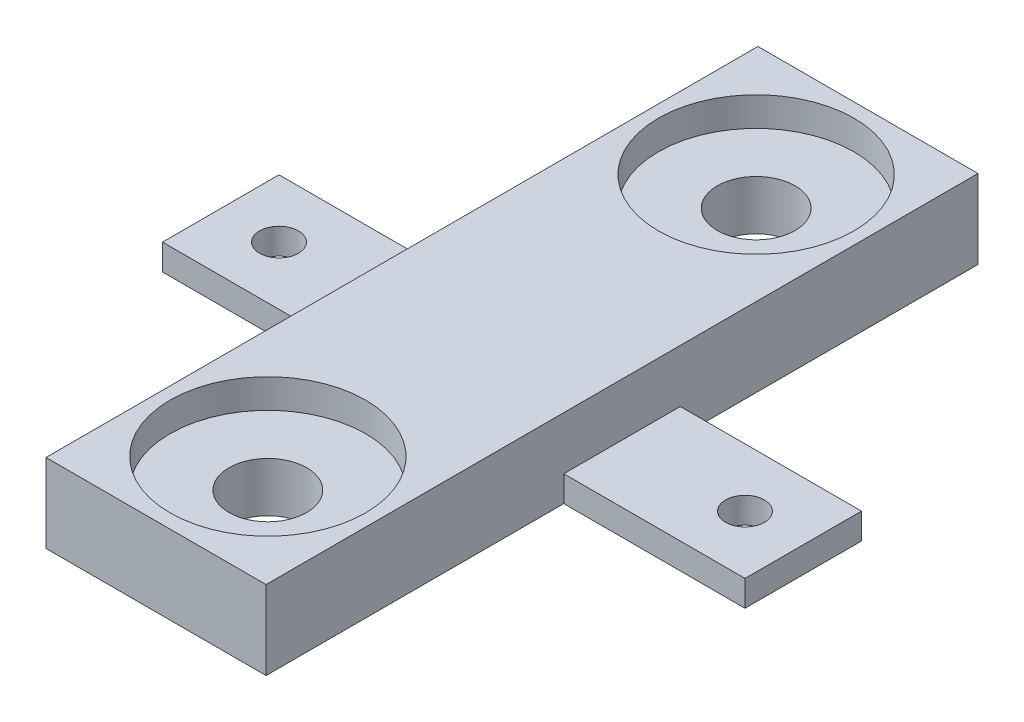
ISO-10303-21;
HEADER;
FILE_DESCRIPTION(('STEP AP214'),'2;1');
FILE_NAME('part.step','',(''),(''),'','','');
FILE_SCHEMA(('AUTOMOTIVE_DESIGN { 1 0 10303 214 1 1 1 1 }'));
ENDSEC;
DATA;
#1=APPLICATION_CONTEXT('core data for automotive mechanical design processes');
#2=APPLICATION_PROTOCOL_DEFINITION('international standard','automotive_design',2000,#1);
#3=PRODUCT_CONTEXT('',#1,'mechanical');
#4=PRODUCT('Part','Part','',(#3));
#5=PRODUCT_RELATED_PRODUCT_CATEGORY('part','',(#4));
#6=PRODUCT_DEFINITION_FORMATION('','',#4);
#7=PRODUCT_DEFINITION_CONTEXT('part definition',#1,'design');
#8=PRODUCT_DEFINITION('design','',#6,#7);
#9=PRODUCT_DEFINITION_SHAPE('','',#8);
#10=(LENGTH_UNIT() NAMED_UNIT(*) SI_UNIT(.MILLI.,.METRE.));
#11=(NAMED_UNIT(*) PLANE_ANGLE_UNIT() SI_UNIT($,.RADIAN.));
#12=(NAMED_UNIT(*) SI_UNIT($,.STERADIAN.) SOLID_ANGLE_UNIT());
#13=UNCERTAINTY_MEASURE_WITH_UNIT(LENGTH_MEASURE(1.E-05),#10,'distance_accuracy_value','');
#14=(GEOMETRIC_REPRESENTATION_CONTEXT(3) GLOBAL_UNCERTAINTY_ASSIGNED_CONTEXT((#13)) GLOBAL_UNIT_ASSIGNED_CONTEXT((#10,
#11,#12)) REPRESENTATION_CONTEXT('',''));
#15=CARTESIAN_POINT('',(0.,0.,0.));
#16=DIRECTION('',(0.,0.,1.));
#17=DIRECTION('',(1.,0.,0.));
#18=AXIS2_PLACEMENT_3D('',#15,#16,#17);
#19=CARTESIAN_POINT('',(0.,2.,0.));
#20=DIRECTION('',(0.,1.,0.));
#21=DIRECTION('',(0.,0.,1.));
#22=AXIS2_PLACEMENT_3D('',#19,#20,#21);
#23=PLANE('',#22);
#24=CARTESIAN_POINT('',(-18.,2.,0.));
#25=DIRECTION('',(0.,1.,0.));
#26=DIRECTION('',(0.,0.,1.));
#27=AXIS2_PLACEMENT_3D('',#24,#25,#26);
#28=CIRCLE('',#27,1.5);
#29=CARTESIAN_POINT('',(-18.,2.,1.5));
#30=VERTEX_POINT('',#29);
#31=EDGE_CURVE('E175',#30,#30,#28,.T.);
#32=ORIENTED_EDGE('',*,*,#31,.F.);
#33=EDGE_LOOP('',(#32));
#34=FACE_BOUND('',#33,.T.);
#35=DIRECTION('',(-1.,0.,0.));
#36=VECTOR('',#35,1.);
#37=CARTESIAN_POINT('',(0.,2.,4.49999999999999));
#38=LINE('',#37,#36);
#39=CARTESIAN_POINT('',(-8.5,2.,4.5));
#40=VERTEX_POINT('',#39);
#41=CARTESIAN_POINT('',(-22.5,2.,4.5));
#42=VERTEX_POINT('',#41);
#43=EDGE_CURVE('E161',#40,#42,#38,.T.);
#44=ORIENTED_EDGE('',*,*,#43,.F.);
#45=DIRECTION('',(0.,0.,-1.));
#46=VECTOR('',#45,1.);
#47=CARTESIAN_POINT('',(-8.5,2.,0.));
#48=LINE('',#47,#46);
#49=CARTESIAN_POINT('',(-8.5,2.,-4.5));
#50=VERTEX_POINT('',#49);
#51=EDGE_CURVE('E261',#40,#50,#48,.T.);
#52=ORIENTED_EDGE('',*,*,#51,.T.);
#53=DIRECTION('',(-1.,0.,0.));
#54=VECTOR('',#53,1.);
#55=CARTESIAN_POINT('',(0.,2.,-4.49999999999999));
#56=LINE('',#55,#54);
#57=CARTESIAN_POINT('',(-22.5,2.,-4.5));
#58=VERTEX_POINT('',#57);
#59=EDGE_CURVE('E144',#50,#58,#56,.T.);
#60=ORIENTED_EDGE('',*,*,#59,.T.);
#61=DIRECTION('',(0.,0.,1.));
#62=VECTOR('',#61,1.);
#63=CARTESIAN_POINT('',(-22.5,2.,0.));
#64=LINE('',#63,#62);
#65=EDGE_CURVE('E275',#58,#42,#64,.T.);
#66=ORIENTED_EDGE('',*,*,#65,.T.);
#67=EDGE_LOOP('',(#44,#52,#60,#66));
#68=FACE_BOUND('',#67,.T.);
#69=ADVANCED_FACE('F70',(#34,#68),#23,.T.);
#70=CARTESIAN_POINT('',(0.,2.,-27.5));
#71=DIRECTION('',(0.,0.,-1.));
#72=DIRECTION('',(-1.,0.,0.));
#73=AXIS2_PLACEMENT_3D('',#70,#71,#72);
#74=PLANE('',#73);
#75=DIRECTION('',(1.,0.,0.));
#76=VECTOR('',#75,1.);
#77=CARTESIAN_POINT('',(0.,0.,-27.5));
#78=LINE('',#77,#76);
#79=CARTESIAN_POINT('',(-8.5,0.,-27.5));
#80=VERTEX_POINT('',#79);
#81=CARTESIAN_POINT('',(8.5,0.,-27.5));
#82=VERTEX_POINT('',#81);
#83=EDGE_CURVE('E186',#80,#82,#78,.T.);
#84=ORIENTED_EDGE('',*,*,#83,.F.);
#85=DIRECTION('',(0.,-1.,0.));
#86=VECTOR('',#85,1.);
#87=CARTESIAN_POINT('',(-8.5,2.,-27.5));
#88=LINE('',#87,#86);
#89=CARTESIAN_POINT('',(-8.5,6.088,-27.5));
#90=VERTEX_POINT('',#89);
#91=EDGE_CURVE('E235',#90,#80,#88,.T.);
#92=ORIENTED_EDGE('',*,*,#91,.F.);
#93=DIRECTION('',(1.,0.,0.));
#94=VECTOR('',#93,1.);
#95=CARTESIAN_POINT('',(0.,6.088,-27.5));
#96=LINE('',#95,#94);
#97=CARTESIAN_POINT('',(8.5,6.088,-27.5));
#98=VERTEX_POINT('',#97);
#99=EDGE_CURVE('E267',#90,#98,#96,.T.);
#100=ORIENTED_EDGE('',*,*,#99,.T.);
#101=DIRECTION('',(0.,-1.,0.));
#102=VECTOR('',#101,1.);
#103=CARTESIAN_POINT('',(8.5,2.,-27.5));
#104=LINE('',#103,#102);
#105=EDGE_CURVE('E237',#98,#82,#104,.T.);
#106=ORIENTED_EDGE('',*,*,#105,.T.);
#107=EDGE_LOOP('',(#84,#92,#100,#106));
#108=FACE_BOUND('',#107,.T.);
#109=ADVANCED_FACE('F72',(#108),#74,.T.);
#110=CARTESIAN_POINT('',(0.,2.,-4.49999999999999));
#111=DIRECTION('',(0.,0.,1.));
#112=DIRECTION('',(1.,0.,0.));
#113=AXIS2_PLACEMENT_3D('',#110,#111,#112);
#114=PLANE('',#113);
#115=DIRECTION('',(-1.,0.,0.));
#116=VECTOR('',#115,1.);
#117=CARTESIAN_POINT('',(0.,0.,-4.49999999999999));
#118=LINE('',#117,#116);
#119=CARTESIAN_POINT('',(-8.5,0.,-4.5));
#120=VERTEX_POINT('',#119);
#121=CARTESIAN_POINT('',(-22.5,0.,-4.5));
#122=VERTEX_POINT('',#121);
#123=EDGE_CURVE('E193',#120,#122,#118,.T.);
#124=ORIENTED_EDGE('',*,*,#123,.T.);
#125=DIRECTION('',(0.,-1.,0.));
#126=VECTOR('',#125,1.);
#127=CARTESIAN_POINT('',(-22.5,2.,-4.5));
#128=LINE('',#127,#126);
#129=EDGE_CURVE('E229',#58,#122,#128,.T.);
#130=ORIENTED_EDGE('',*,*,#129,.F.);
#131=ORIENTED_EDGE('',*,*,#59,.F.);
#132=DIRECTION('',(0.,-1.,0.));
#133=VECTOR('',#132,1.);
#134=CARTESIAN_POINT('',(-8.5,2.,-4.5));
#135=LINE('',#134,#133);
#136=EDGE_CURVE('E232',#50,#120,#135,.T.);
#137=ORIENTED_EDGE('',*,*,#136,.T.);
#138=EDGE_LOOP('',(#124,#130,#131,#137));
#139=FACE_BOUND('',#138,.T.);
#140=ADVANCED_FACE('F342',(#139),#114,.F.);
#141=CARTESIAN_POINT('',(-22.5,2.,0.));
#142=DIRECTION('',(1.,0.,0.));
#143=DIRECTION('',(0.,0.,-1.));
#144=AXIS2_PLACEMENT_3D('',#141,#142,#143);
#145=PLANE('',#144);
#146=DIRECTION('',(0.,0.,1.));
#147=VECTOR('',#146,1.);
#148=CARTESIAN_POINT('',(-22.5,0.,0.));
#149=LINE('',#148,#147);
#150=CARTESIAN_POINT('',(-22.5,0.,4.5));
#151=VERTEX_POINT('',#150);
#152=EDGE_CURVE('E196',#122,#151,#149,.T.);
#153=ORIENTED_EDGE('',*,*,#152,.T.);
#154=DIRECTION('',(0.,-1.,0.));
#155=VECTOR('',#154,1.);
#156=CARTESIAN_POINT('',(-22.5,2.,4.5));
#157=LINE('',#156,#155);
#158=EDGE_CURVE('E227',#42,#151,#157,.T.);
#159=ORIENTED_EDGE('',*,*,#158,.F.);
#160=ORIENTED_EDGE('',*,*,#65,.F.);
#161=ORIENTED_EDGE('',*,*,#129,.T.);
#162=EDGE_LOOP('',(#153,#159,#160,#161));
#163=FACE_BOUND('',#162,.T.);
#164=ADVANCED_FACE('F496',(#163),#145,.F.);
#165=CARTESIAN_POINT('',(0.,2.,4.49999999999999));
#166=DIRECTION('',(0.,0.,1.));
#167=DIRECTION('',(1.,0.,0.));
#168=AXIS2_PLACEMENT_3D('',#165,#166,#167);
#169=PLANE('',#168);
#170=DIRECTION('',(-1.,0.,0.));
#171=VECTOR('',#170,1.);
#172=CARTESIAN_POINT('',(0.,0.,4.49999999999999));
#173=LINE('',#172,#171);
#174=CARTESIAN_POINT('',(-8.5,0.,4.49999999999999));
#175=VERTEX_POINT('',#174);
#176=EDGE_CURVE('E199',#175,#151,#173,.T.);
#177=ORIENTED_EDGE('',*,*,#176,.F.);
#178=DIRECTION('',(0.,-1.,0.));
#179=VECTOR('',#178,1.);
#180=CARTESIAN_POINT('',(-8.5,2.,4.49999999999999));
#181=LINE('',#180,#179);
#182=EDGE_CURVE('E225',#40,#175,#181,.T.);
#183=ORIENTED_EDGE('',*,*,#182,.F.);
#184=ORIENTED_EDGE('',*,*,#43,.T.);
#185=ORIENTED_EDGE('',*,*,#158,.T.);
#186=EDGE_LOOP('',(#177,#183,#184,#185));
#187=FACE_BOUND('',#186,.T.);
#188=ADVANCED_FACE('F281',(#187),#169,.T.);
#189=CARTESIAN_POINT('',(-8.5,2.,0.));
#190=DIRECTION('',(1.,0.,0.));
#191=DIRECTION('',(0.,0.,-1.));
#192=AXIS2_PLACEMENT_3D('',#189,#190,#191);
#193=PLANE('',#192);
#194=DIRECTION('',(0.,0.,1.));
#195=VECTOR('',#194,1.);
#196=CARTESIAN_POINT('',(-8.5,0.,0.));
#197=LINE('',#196,#195);
#198=CARTESIAN_POINT('',(-8.49999999999999,0.,27.5));
#199=VERTEX_POINT('',#198);
#200=EDGE_CURVE('E194',#175,#199,#197,.T.);
#201=ORIENTED_EDGE('',*,*,#200,.T.);
#202=DIRECTION('',(0.,-1.,0.));
#203=VECTOR('',#202,1.);
#204=CARTESIAN_POINT('',(-8.49999999999999,2.,27.5));
#205=LINE('',#204,#203);
#206=CARTESIAN_POINT('',(-8.49999999999999,6.088,27.5));
#207=VERTEX_POINT('',#206);
#208=EDGE_CURVE('E222',#207,#199,#205,.T.);
#209=ORIENTED_EDGE('',*,*,#208,.F.);
#210=DIRECTION('',(0.,0.,1.));
#211=VECTOR('',#210,1.);
#212=CARTESIAN_POINT('',(-8.5,6.088,0.));
#213=LINE('',#212,#211);
#214=EDGE_CURVE('E187',#90,#207,#213,.T.);
#215=ORIENTED_EDGE('',*,*,#214,.F.);
#216=ORIENTED_EDGE('',*,*,#91,.T.);
#217=EDGE_CURVE('E191',#80,#120,#197,.T.);
#218=ORIENTED_EDGE('',*,*,#217,.T.);
#219=ORIENTED_EDGE('',*,*,#136,.F.);
#220=ORIENTED_EDGE('',*,*,#51,.F.);
#221=ORIENTED_EDGE('',*,*,#182,.T.);
#222=EDGE_LOOP('',(#201,#209,#215,#216,#218,#219,#220,#221));
#223=FACE_BOUND('',#222,.T.);
#224=ADVANCED_FACE('F317',(#223),#193,.F.);
#225=CARTESIAN_POINT('',(0.,2.,27.5));
#226=DIRECTION('',(0.,0.,-1.));
#227=DIRECTION('',(-1.,0.,0.));
#228=AXIS2_PLACEMENT_3D('',#225,#226,#227);
#229=PLANE('',#228);
#230=DIRECTION('',(1.,0.,0.));
#231=VECTOR('',#230,1.);
#232=CARTESIAN_POINT('',(0.,0.,27.5));
#233=LINE('',#232,#231);
#234=CARTESIAN_POINT('',(8.5,0.,27.5));
#235=VERTEX_POINT('',#234);
#236=EDGE_CURVE('E202',#199,#235,#233,.T.);
#237=ORIENTED_EDGE('',*,*,#236,.T.);
#238=DIRECTION('',(0.,-1.,0.));
#239=VECTOR('',#238,1.);
#240=CARTESIAN_POINT('',(8.5,2.,27.5));
#241=LINE('',#240,#239);
#242=CARTESIAN_POINT('',(8.5,6.088,27.5));
#243=VERTEX_POINT('',#242);
#244=EDGE_CURVE('E220',#243,#235,#241,.T.);
#245=ORIENTED_EDGE('',*,*,#244,.F.);
#246=DIRECTION('',(1.,0.,0.));
#247=VECTOR('',#246,1.);
#248=CARTESIAN_POINT('',(0.,6.088,27.5));
#249=LINE('',#248,#247);
#250=EDGE_CURVE('E258',#207,#243,#249,.T.);
#251=ORIENTED_EDGE('',*,*,#250,.F.);
#252=ORIENTED_EDGE('',*,*,#208,.T.);
#253=EDGE_LOOP('',(#237,#245,#251,#252));
#254=FACE_BOUND('',#253,.T.);
#255=ADVANCED_FACE('F304',(#254),#229,.F.);
#256=CARTESIAN_POINT('',(8.5,2.,0.));
#257=DIRECTION('',(1.,0.,0.));
#258=DIRECTION('',(0.,0.,-1.));
#259=AXIS2_PLACEMENT_3D('',#256,#257,#258);
#260=PLANE('',#259);
#261=DIRECTION('',(0.,0.,1.));
#262=VECTOR('',#261,1.);
#263=CARTESIAN_POINT('',(8.5,0.,0.));
#264=LINE('',#263,#262);
#265=CARTESIAN_POINT('',(8.5,0.,4.5));
#266=VERTEX_POINT('',#265);
#267=EDGE_CURVE('E188',#266,#235,#264,.T.);
#268=ORIENTED_EDGE('',*,*,#267,.F.);
#269=DIRECTION('',(0.,-1.,0.));
#270=VECTOR('',#269,1.);
#271=CARTESIAN_POINT('',(8.5,2.,4.5));
#272=LINE('',#271,#270);
#273=CARTESIAN_POINT('',(8.5,2.,4.49999999999999));
#274=VERTEX_POINT('',#273);
#275=EDGE_CURVE('E170',#274,#266,#272,.T.);
#276=ORIENTED_EDGE('',*,*,#275,.F.);
#277=DIRECTION('',(0.,0.,-1.));
#278=VECTOR('',#277,1.);
#279=CARTESIAN_POINT('',(8.5,2.,0.));
#280=LINE('',#279,#278);
#281=CARTESIAN_POINT('',(8.5,2.,-4.5));
#282=VERTEX_POINT('',#281);
#283=EDGE_CURVE('E89',#274,#282,#280,.T.);
#284=ORIENTED_EDGE('',*,*,#283,.T.);
#285=DIRECTION('',(0.,-1.,0.));
#286=VECTOR('',#285,1.);
#287=CARTESIAN_POINT('',(8.5,2.,-4.5));
#288=LINE('',#287,#286);
#289=CARTESIAN_POINT('',(8.5,0.,-4.5));
#290=VERTEX_POINT('',#289);
#291=EDGE_CURVE('E135',#282,#290,#288,.T.);
#292=ORIENTED_EDGE('',*,*,#291,.T.);
#293=EDGE_CURVE('E184',#82,#290,#264,.T.);
#294=ORIENTED_EDGE('',*,*,#293,.F.);
#295=ORIENTED_EDGE('',*,*,#105,.F.);
#296=DIRECTION('',(0.,0.,1.));
#297=VECTOR('',#296,1.);
#298=CARTESIAN_POINT('',(8.5,6.088,0.));
#299=LINE('',#298,#297);
#300=EDGE_CURVE('E264',#98,#243,#299,.T.);
#301=ORIENTED_EDGE('',*,*,#300,.T.);
#302=ORIENTED_EDGE('',*,*,#244,.T.);
#303=EDGE_LOOP('',(#268,#276,#284,#292,#294,#295,#301,#302));
#304=FACE_BOUND('',#303,.T.);
#305=ADVANCED_FACE('F313',(#304),#260,.T.);
#306=CARTESIAN_POINT('',(0.,2.,4.5));
#307=DIRECTION('',(0.,0.,-1.));
#308=DIRECTION('',(-1.,0.,0.));
#309=AXIS2_PLACEMENT_3D('',#306,#307,#308);
#310=PLANE('',#309);
#311=DIRECTION('',(1.,0.,0.));
#312=VECTOR('',#311,1.);
#313=CARTESIAN_POINT('',(0.,0.,4.5));
#314=LINE('',#313,#312);
#315=CARTESIAN_POINT('',(22.5,0.,4.49999999999999));
#316=VERTEX_POINT('',#315);
#317=EDGE_CURVE('E167',#266,#316,#314,.T.);
#318=ORIENTED_EDGE('',*,*,#317,.T.);
#319=DIRECTION('',(0.,-1.,0.));
#320=VECTOR('',#319,1.);
#321=CARTESIAN_POINT('',(22.5,2.,4.49999999999999));
#322=LINE('',#321,#320);
#323=CARTESIAN_POINT('',(22.5,2.,4.49999999999999));
#324=VERTEX_POINT('',#323);
#325=EDGE_CURVE('E164',#324,#316,#322,.T.);
#326=ORIENTED_EDGE('',*,*,#325,.F.);
#327=DIRECTION('',(1.,0.,0.));
#328=VECTOR('',#327,1.);
#329=CARTESIAN_POINT('',(0.,2.,4.5));
#330=LINE('',#329,#328);
#331=EDGE_CURVE('E153',#274,#324,#330,.T.);
#332=ORIENTED_EDGE('',*,*,#331,.F.);
#333=ORIENTED_EDGE('',*,*,#275,.T.);
#334=EDGE_LOOP('',(#318,#326,#332,#333));
#335=FACE_BOUND('',#334,.T.);
#336=ADVANCED_FACE('F165',(#335),#310,.F.);
#337=CARTESIAN_POINT('',(22.5,2.,0.));
#338=DIRECTION('',(1.,0.,0.));
#339=DIRECTION('',(0.,0.,-1.));
#340=AXIS2_PLACEMENT_3D('',#337,#338,#339);
#341=PLANE('',#340);
#342=DIRECTION('',(0.,0.,1.));
#343=VECTOR('',#342,1.);
#344=CARTESIAN_POINT('',(22.5,0.,0.));
#345=LINE('',#344,#343);
#346=CARTESIAN_POINT('',(22.5,0.,-4.50000000000001));
#347=VERTEX_POINT('',#346);
#348=EDGE_CURVE('E206',#347,#316,#345,.T.);
#349=ORIENTED_EDGE('',*,*,#348,.F.);
#350=DIRECTION('',(0.,-1.,0.));
#351=VECTOR('',#350,1.);
#352=CARTESIAN_POINT('',(22.5,2.,-4.50000000000001));
#353=LINE('',#352,#351);
#354=CARTESIAN_POINT('',(22.5,2.,-4.50000000000001));
#355=VERTEX_POINT('',#354);
#356=EDGE_CURVE('E131',#355,#347,#353,.T.);
#357=ORIENTED_EDGE('',*,*,#356,.F.);
#358=DIRECTION('',(0.,0.,1.));
#359=VECTOR('',#358,1.);
#360=CARTESIAN_POINT('',(22.5,2.,0.));
#361=LINE('',#360,#359);
#362=EDGE_CURVE('E159',#355,#324,#361,.T.);
#363=ORIENTED_EDGE('',*,*,#362,.T.);
#364=ORIENTED_EDGE('',*,*,#325,.T.);
#365=EDGE_LOOP('',(#349,#357,#363,#364));
#366=FACE_BOUND('',#365,.T.);
#367=ADVANCED_FACE('F172',(#366),#341,.T.);
#368=CARTESIAN_POINT('',(-18.,2.,0.));
#369=DIRECTION('',(0.,-1.,0.));
#370=DIRECTION('',(0.,0.,-1.));
#371=AXIS2_PLACEMENT_3D('',#368,#369,#370);
#372=CYLINDRICAL_SURFACE('',#371,1.5);
#373=ORIENTED_EDGE('',*,*,#31,.T.);
#374=EDGE_LOOP('',(#373));
#375=FACE_BOUND('',#374,.T.);
#376=CARTESIAN_POINT('',(-18.,0.,0.));
#377=DIRECTION('',(0.,1.,0.));
#378=DIRECTION('',(0.,0.,1.));
#379=AXIS2_PLACEMENT_3D('',#376,#377,#378);
#380=CIRCLE('',#379,1.5);
#381=CARTESIAN_POINT('',(-18.,0.,1.5));
#382=VERTEX_POINT('',#381);
#383=EDGE_CURVE('E211',#382,#382,#380,.T.);
#384=ORIENTED_EDGE('',*,*,#383,.F.);
#385=EDGE_LOOP('',(#384));
#386=FACE_BOUND('',#385,.T.);
#387=ADVANCED_FACE('F325',(#375,#386),#372,.F.);
#388=CARTESIAN_POINT('',(0.,2.,-4.49999999999999));
#389=DIRECTION('',(0.,0.,-1.));
#390=DIRECTION('',(-1.,0.,0.));
#391=AXIS2_PLACEMENT_3D('',#388,#389,#390);
#392=PLANE('',#391);
#393=DIRECTION('',(1.,0.,0.));
#394=VECTOR('',#393,1.);
#395=CARTESIAN_POINT('',(0.,0.,-4.49999999999999));
#396=LINE('',#395,#394);
#397=EDGE_CURVE('E208',#290,#347,#396,.T.);
#398=ORIENTED_EDGE('',*,*,#397,.F.);
#399=ORIENTED_EDGE('',*,*,#291,.F.);
#400=DIRECTION('',(1.,0.,0.));
#401=VECTOR('',#400,1.);
#402=CARTESIAN_POINT('',(0.,2.,-4.49999999999999));
#403=LINE('',#402,#401);
#404=EDGE_CURVE('E173',#282,#355,#403,.T.);
#405=ORIENTED_EDGE('',*,*,#404,.T.);
#406=ORIENTED_EDGE('',*,*,#356,.T.);
#407=EDGE_LOOP('',(#398,#399,#405,#406));
#408=FACE_BOUND('',#407,.T.);
#409=ADVANCED_FACE('F322',(#408),#392,.T.);
#410=CARTESIAN_POINT('',(18.,2.,0.));
#411=DIRECTION('',(0.,-1.,0.));
#412=DIRECTION('',(0.,0.,-1.));
#413=AXIS2_PLACEMENT_3D('',#410,#411,#412);
#414=CYLINDRICAL_SURFACE('',#413,1.5);
#415=CARTESIAN_POINT('',(18.,2.,0.));
#416=DIRECTION('',(0.,1.,0.));
#417=DIRECTION('',(0.,0.,1.));
#418=AXIS2_PLACEMENT_3D('',#415,#416,#417);
#419=CIRCLE('',#418,1.5);
#420=CARTESIAN_POINT('',(18.,2.,1.49999999999999));
#421=VERTEX_POINT('',#420);
#422=EDGE_CURVE('E181',#421,#421,#419,.T.);
#423=ORIENTED_EDGE('',*,*,#422,.T.);
#424=EDGE_LOOP('',(#423));
#425=FACE_BOUND('',#424,.T.);
#426=CARTESIAN_POINT('',(18.,0.,0.));
#427=DIRECTION('',(0.,1.,0.));
#428=DIRECTION('',(0.,0.,1.));
#429=AXIS2_PLACEMENT_3D('',#426,#427,#428);
#430=CIRCLE('',#429,1.5);
#431=CARTESIAN_POINT('',(18.,0.,1.49999999999999));
#432=VERTEX_POINT('',#431);
#433=EDGE_CURVE('E214',#432,#432,#430,.T.);
#434=ORIENTED_EDGE('',*,*,#433,.F.);
#435=EDGE_LOOP('',(#434));
#436=FACE_BOUND('',#435,.T.);
#437=ADVANCED_FACE('F324',(#425,#436),#414,.F.);
#438=ORIENTED_EDGE('',*,*,#283,.F.);
#439=ORIENTED_EDGE('',*,*,#331,.T.);
#440=ORIENTED_EDGE('',*,*,#362,.F.);
#441=ORIENTED_EDGE('',*,*,#404,.F.);
#442=EDGE_LOOP('',(#438,#439,#440,#441));
#443=FACE_BOUND('',#442,.T.);
#444=ORIENTED_EDGE('',*,*,#422,.F.);
#445=EDGE_LOOP('',(#444));
#446=FACE_BOUND('',#445,.T.);
#447=ADVANCED_FACE('F155',(#443,#446),#23,.T.);
#448=CARTESIAN_POINT('',(0.,0.,0.));
#449=DIRECTION('',(0.,1.,0.));
#450=DIRECTION('',(0.,0.,1.));
#451=AXIS2_PLACEMENT_3D('',#448,#449,#450);
#452=PLANE('',#451);
#453=CARTESIAN_POINT('',(0.,0.,-18.8625));
#454=DIRECTION('',(0.,-1.,0.));
#455=DIRECTION('',(0.,0.,-1.));
#456=AXIS2_PLACEMENT_3D('',#453,#454,#455);
#457=CIRCLE('',#456,3.);
#458=CARTESIAN_POINT('',(0.,0.,-21.8625));
#459=VERTEX_POINT('',#458);
#460=EDGE_CURVE('E240',#459,#459,#457,.T.);
#461=ORIENTED_EDGE('',*,*,#460,.F.);
#462=EDGE_LOOP('',(#461));
#463=FACE_BOUND('',#462,.T.);
#464=CARTESIAN_POINT('',(0.,0.,18.8625));
#465=DIRECTION('',(0.,-1.,0.));
#466=DIRECTION('',(0.,0.,-1.));
#467=AXIS2_PLACEMENT_3D('',#464,#465,#466);
#468=CIRCLE('',#467,3.);
#469=CARTESIAN_POINT('',(0.,0.,15.8625));
#470=VERTEX_POINT('',#469);
#471=EDGE_CURVE('E246',#470,#470,#468,.T.);
#472=ORIENTED_EDGE('',*,*,#471,.F.);
#473=EDGE_LOOP('',(#472));
#474=FACE_BOUND('',#473,.T.);
#475=ORIENTED_EDGE('',*,*,#293,.T.);
#476=ORIENTED_EDGE('',*,*,#397,.T.);
#477=ORIENTED_EDGE('',*,*,#348,.T.);
#478=ORIENTED_EDGE('',*,*,#317,.F.);
#479=ORIENTED_EDGE('',*,*,#267,.T.);
#480=ORIENTED_EDGE('',*,*,#236,.F.);
#481=ORIENTED_EDGE('',*,*,#200,.F.);
#482=ORIENTED_EDGE('',*,*,#176,.T.);
#483=ORIENTED_EDGE('',*,*,#152,.F.);
#484=ORIENTED_EDGE('',*,*,#123,.F.);
#485=ORIENTED_EDGE('',*,*,#217,.F.);
#486=ORIENTED_EDGE('',*,*,#83,.T.);
#487=EDGE_LOOP('',(#475,#476,#477,#478,#479,#480,#481,#482,#483,#484,#485,#486));
#488=FACE_BOUND('',#487,.T.);
#489=ORIENTED_EDGE('',*,*,#383,.T.);
#490=EDGE_LOOP('',(#489));
#491=FACE_BOUND('',#490,.T.);
#492=ORIENTED_EDGE('',*,*,#433,.T.);
#493=EDGE_LOOP('',(#492));
#494=FACE_BOUND('',#493,.T.);
#495=ADVANCED_FACE('F320',(#463,#474,#488,#491,#494),#452,.F.);
#496=CARTESIAN_POINT('',(0.,6.088,0.));
#497=DIRECTION('',(0.,-1.,0.));
#498=DIRECTION('',(0.,0.,-1.));
#499=AXIS2_PLACEMENT_3D('',#496,#497,#498);
#500=PLANE('',#499);
#501=CARTESIAN_POINT('',(0.,6.088,18.8625));
#502=DIRECTION('',(0.,-1.,0.));
#503=DIRECTION('',(0.,0.,-1.));
#504=AXIS2_PLACEMENT_3D('',#501,#502,#503);
#505=CIRCLE('',#504,7.55);
#506=CARTESIAN_POINT('',(0.,6.088,11.3125));
#507=VERTEX_POINT('',#506);
#508=EDGE_CURVE('E244',#507,#507,#505,.T.);
#509=ORIENTED_EDGE('',*,*,#508,.T.);
#510=EDGE_LOOP('',(#509));
#511=FACE_BOUND('',#510,.T.);
#512=CARTESIAN_POINT('',(0.,6.088,-18.8625));
#513=DIRECTION('',(0.,-1.,0.));
#514=DIRECTION('',(0.,0.,-1.));
#515=AXIS2_PLACEMENT_3D('',#512,#513,#514);
#516=CIRCLE('',#515,7.55);
#517=CARTESIAN_POINT('',(0.,6.088,-26.4125));
#518=VERTEX_POINT('',#517);
#519=EDGE_CURVE('E254',#518,#518,#516,.T.);
#520=ORIENTED_EDGE('',*,*,#519,.T.);
#521=EDGE_LOOP('',(#520));
#522=FACE_BOUND('',#521,.T.);
#523=ORIENTED_EDGE('',*,*,#250,.T.);
#524=ORIENTED_EDGE('',*,*,#300,.F.);
#525=ORIENTED_EDGE('',*,*,#99,.F.);
#526=ORIENTED_EDGE('',*,*,#214,.T.);
#527=EDGE_LOOP('',(#523,#524,#525,#526));
#528=FACE_BOUND('',#527,.T.);
#529=ADVANCED_FACE('F310',(#511,#522,#528),#500,.F.);
#530=CARTESIAN_POINT('',(0.,6.088,-18.8625));
#531=DIRECTION('',(0.,-1.,0.));
#532=DIRECTION('',(0.,0.,-1.));
#533=AXIS2_PLACEMENT_3D('',#530,#531,#532);
#534=CYLINDRICAL_SURFACE('',#533,7.55);
#535=ORIENTED_EDGE('',*,*,#519,.F.);
#536=EDGE_LOOP('',(#535));
#537=FACE_BOUND('',#536,.T.);
#538=CARTESIAN_POINT('',(0.,3.838,-18.8625));
#539=DIRECTION('',(0.,-1.,0.));
#540=DIRECTION('',(0.,0.,-1.));
#541=AXIS2_PLACEMENT_3D('',#538,#539,#540);
#542=CIRCLE('',#541,7.55);
#543=CARTESIAN_POINT('',(0.,3.838,-26.4125));
#544=VERTEX_POINT('',#543);
#545=EDGE_CURVE('E80',#544,#544,#542,.T.);
#546=ORIENTED_EDGE('',*,*,#545,.T.);
#547=EDGE_LOOP('',(#546));
#548=FACE_BOUND('',#547,.T.);
#549=ADVANCED_FACE('F354',(#537,#548),#534,.F.);
#550=CARTESIAN_POINT('',(0.,6.088,18.8625));
#551=DIRECTION('',(0.,-1.,0.));
#552=DIRECTION('',(0.,0.,-1.));
#553=AXIS2_PLACEMENT_3D('',#550,#551,#552);
#554=CYLINDRICAL_SURFACE('',#553,7.55);
#555=ORIENTED_EDGE('',*,*,#508,.F.);
#556=EDGE_LOOP('',(#555));
#557=FACE_BOUND('',#556,.T.);
#558=CARTESIAN_POINT('',(0.,3.838,18.8625));
#559=DIRECTION('',(0.,-1.,0.));
#560=DIRECTION('',(0.,0.,-1.));
#561=AXIS2_PLACEMENT_3D('',#558,#559,#560);
#562=CIRCLE('',#561,7.55);
#563=CARTESIAN_POINT('',(0.,3.838,11.3125));
#564=VERTEX_POINT('',#563);
#565=EDGE_CURVE('E12',#564,#564,#562,.T.);
#566=ORIENTED_EDGE('',*,*,#565,.T.);
#567=EDGE_LOOP('',(#566));
#568=FACE_BOUND('',#567,.T.);
#569=ADVANCED_FACE('F373',(#557,#568),#554,.F.);
#570=CARTESIAN_POINT('',(0.,3.838,0.));
#571=DIRECTION('',(0.,-1.,0.));
#572=DIRECTION('',(0.,0.,-1.));
#573=AXIS2_PLACEMENT_3D('',#570,#571,#572);
#574=PLANE('',#573);
#575=CARTESIAN_POINT('',(0.,3.838,-18.8625));
#576=DIRECTION('',(0.,-1.,0.));
#577=DIRECTION('',(0.,0.,-1.));
#578=AXIS2_PLACEMENT_3D('',#575,#576,#577);
#579=CIRCLE('',#578,3.);
#580=CARTESIAN_POINT('',(0.,3.838,-21.8625));
#581=VERTEX_POINT('',#580);
#582=EDGE_CURVE('E74',#581,#581,#579,.T.);
#583=ORIENTED_EDGE('',*,*,#582,.T.);
#584=EDGE_LOOP('',(#583));
#585=FACE_BOUND('',#584,.T.);
#586=ORIENTED_EDGE('',*,*,#545,.F.);
#587=EDGE_LOOP('',(#586));
#588=FACE_BOUND('',#587,.T.);
#589=ADVANCED_FACE('F371',(#585,#588),#574,.F.);
#590=CARTESIAN_POINT('',(0.,3.838,18.8625));
#591=DIRECTION('',(0.,-1.,0.));
#592=DIRECTION('',(0.,0.,-1.));
#593=AXIS2_PLACEMENT_3D('',#590,#591,#592);
#594=CIRCLE('',#593,3.);
#595=CARTESIAN_POINT('',(0.,3.838,15.8625));
#596=VERTEX_POINT('',#595);
#597=EDGE_CURVE('E238',#596,#596,#594,.T.);
#598=ORIENTED_EDGE('',*,*,#597,.T.);
#599=EDGE_LOOP('',(#598));
#600=FACE_BOUND('',#599,.T.);
#601=ORIENTED_EDGE('',*,*,#565,.F.);
#602=EDGE_LOOP('',(#601));
#603=FACE_BOUND('',#602,.T.);
#604=ADVANCED_FACE('F364',(#600,#603),#574,.F.);
#605=CARTESIAN_POINT('',(0.,6.088,18.8625));
#606=DIRECTION('',(0.,-1.,0.));
#607=DIRECTION('',(0.,0.,-1.));
#608=AXIS2_PLACEMENT_3D('',#605,#606,#607);
#609=CYLINDRICAL_SURFACE('',#608,3.);
#610=ORIENTED_EDGE('',*,*,#471,.T.);
#611=EDGE_LOOP('',(#610));
#612=FACE_BOUND('',#611,.T.);
#613=ORIENTED_EDGE('',*,*,#597,.F.);
#614=EDGE_LOOP('',(#613));
#615=FACE_BOUND('',#614,.T.);
#616=ADVANCED_FACE('F360',(#612,#615),#609,.F.);
#617=CARTESIAN_POINT('',(0.,6.088,-18.8625));
#618=DIRECTION('',(0.,-1.,0.));
#619=DIRECTION('',(0.,0.,-1.));
#620=AXIS2_PLACEMENT_3D('',#617,#618,#619);
#621=CYLINDRICAL_SURFACE('',#620,3.);
#622=ORIENTED_EDGE('',*,*,#460,.T.);
#623=EDGE_LOOP('',(#622));
#624=FACE_BOUND('',#623,.T.);
#625=ORIENTED_EDGE('',*,*,#582,.F.);
#626=EDGE_LOOP('',(#625));
#627=FACE_BOUND('',#626,.T.);
#628=ADVANCED_FACE('F363',(#624,#627),#621,.F.);
#629=CLOSED_SHELL('',(#69,#109,#140,#164,#188,#224,#255,#305,#336,#367,#387,#409,#437,#447,#495,
#529,#549,#569,#589,#604,#616,#628));
#630=MANIFOLD_SOLID_BREP('B2',#629);
#631=ADVANCED_BREP_SHAPE_REPRESENTATION('',(#18,#630),#14);
#632=SHAPE_DEFINITION_REPRESENTATION(#9,#631);
ENDSEC;
END-ISO-10303-21;
